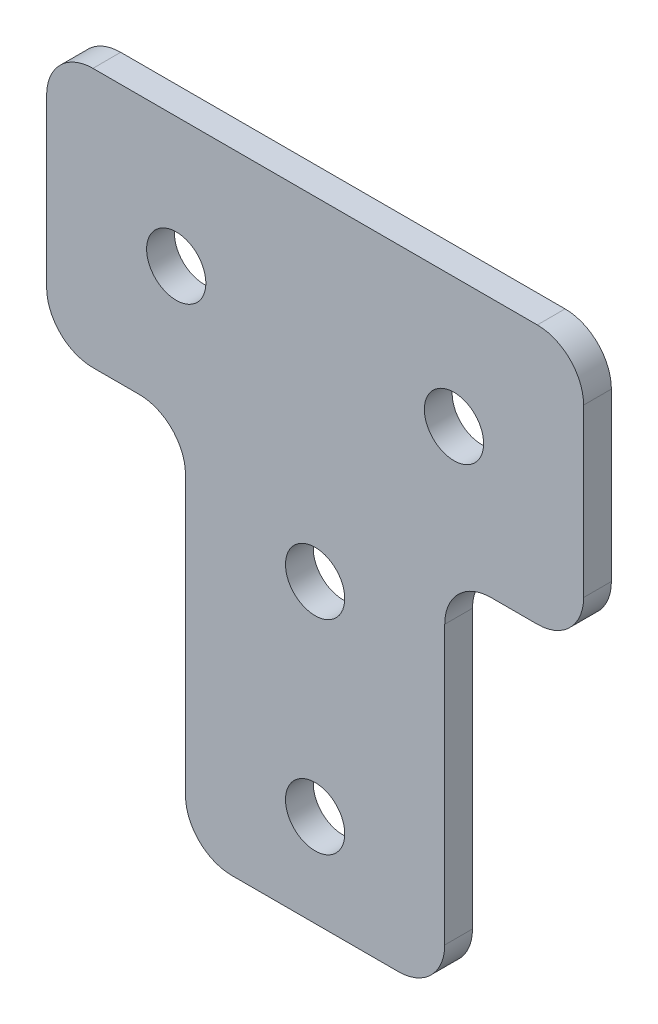
ISO-10303-21;
HEADER;
FILE_DESCRIPTION(('STEP AP214'),'2;1');
FILE_NAME('part.step','',(''),(''),'','','');
FILE_SCHEMA(('AUTOMOTIVE_DESIGN { 1 0 10303 214 1 1 1 1 }'));
ENDSEC;
DATA;
#1=APPLICATION_CONTEXT('core data for automotive mechanical design processes');
#2=APPLICATION_PROTOCOL_DEFINITION('international standard','automotive_design',2000,#1);
#3=PRODUCT_CONTEXT('',#1,'mechanical');
#4=PRODUCT('Part','Part','',(#3));
#5=PRODUCT_RELATED_PRODUCT_CATEGORY('part','',(#4));
#6=PRODUCT_DEFINITION_FORMATION('','',#4);
#7=PRODUCT_DEFINITION_CONTEXT('part definition',#1,'design');
#8=PRODUCT_DEFINITION('design','',#6,#7);
#9=PRODUCT_DEFINITION_SHAPE('','',#8);
#10=(LENGTH_UNIT() NAMED_UNIT(*) SI_UNIT(.MILLI.,.METRE.));
#11=(NAMED_UNIT(*) PLANE_ANGLE_UNIT() SI_UNIT($,.RADIAN.));
#12=(NAMED_UNIT(*) SI_UNIT($,.STERADIAN.) SOLID_ANGLE_UNIT());
#13=UNCERTAINTY_MEASURE_WITH_UNIT(LENGTH_MEASURE(1.E-05),#10,'distance_accuracy_value','');
#14=(GEOMETRIC_REPRESENTATION_CONTEXT(3) GLOBAL_UNCERTAINTY_ASSIGNED_CONTEXT((#13)) GLOBAL_UNIT_ASSIGNED_CONTEXT((#10,
#11,#12)) REPRESENTATION_CONTEXT('',''));
#15=CARTESIAN_POINT('',(0.,0.,0.));
#16=DIRECTION('',(0.,0.,1.));
#17=DIRECTION('',(1.,0.,0.));
#18=AXIS2_PLACEMENT_3D('',#15,#16,#17);
#19=CARTESIAN_POINT('',(-16.5163268204101,5.70798729371791,0.0587796146937763));
#20=DIRECTION('',(1.,0.,0.));
#21=DIRECTION('',(0.,0.,-1.));
#22=AXIS2_PLACEMENT_3D('',#19,#20,#21);
#23=PLANE('',#22);
#24=DIRECTION('',(0.,-1.,0.));
#25=VECTOR('',#24,1.);
#26=CARTESIAN_POINT('',(-16.5163268204101,5.70798729371791,-1.44122038530622));
#27=LINE('',#26,#25);
#28=CARTESIAN_POINT('',(-16.5163268204101,17.2079872937179,-1.44122038530622));
#29=VERTEX_POINT('',#28);
#30=CARTESIAN_POINT('',(-16.5163268204101,8.20798729371791,-1.44122038530622));
#31=VERTEX_POINT('',#30);
#32=EDGE_CURVE('E235',#29,#31,#27,.T.);
#33=ORIENTED_EDGE('',*,*,#32,.T.);
#34=DIRECTION('',(0.,0.,-1.));
#35=VECTOR('',#34,1.);
#36=CARTESIAN_POINT('',(-16.5163268204101,8.20798729371791,0.0587796146937763));
#37=LINE('',#36,#35);
#38=CARTESIAN_POINT('',(-16.5163268204101,8.20798729371791,0.0587796146937763));
#39=VERTEX_POINT('',#38);
#40=EDGE_CURVE('E217',#31,#39,#37,.F.);
#41=ORIENTED_EDGE('',*,*,#40,.T.);
#42=DIRECTION('',(0.,-1.,0.));
#43=VECTOR('',#42,1.);
#44=CARTESIAN_POINT('',(-16.5163268204101,5.70798729371791,0.0587796146937763));
#45=LINE('',#44,#43);
#46=CARTESIAN_POINT('',(-16.5163268204101,17.2079872937179,0.0587796146937763));
#47=VERTEX_POINT('',#46);
#48=EDGE_CURVE('E156',#47,#39,#45,.T.);
#49=ORIENTED_EDGE('',*,*,#48,.F.);
#50=DIRECTION('',(0.,0.,-1.));
#51=VECTOR('',#50,1.);
#52=CARTESIAN_POINT('',(-16.5163268204101,17.2079872937179,0.0587796146937763));
#53=LINE('',#52,#51);
#54=EDGE_CURVE('E214',#47,#29,#53,.T.);
#55=ORIENTED_EDGE('',*,*,#54,.T.);
#56=EDGE_LOOP('',(#33,#41,#49,#55));
#57=FACE_BOUND('',#56,.T.);
#58=ADVANCED_FACE('F16',(#57),#23,.F.);
#59=CARTESIAN_POINT('',(-16.5163268204101,5.70798729371791,0.0587796146937763));
#60=DIRECTION('',(0.,1.,0.));
#61=DIRECTION('',(0.,0.,1.));
#62=AXIS2_PLACEMENT_3D('',#59,#60,#61);
#63=PLANE('',#62);
#64=DIRECTION('',(1.,0.,0.));
#65=VECTOR('',#64,1.);
#66=CARTESIAN_POINT('',(-16.5163268204101,5.70798729371791,-1.44122038530622));
#67=LINE('',#66,#65);
#68=CARTESIAN_POINT('',(-14.0163268204101,5.70798729371791,-1.44122038530622));
#69=VERTEX_POINT('',#68);
#70=CARTESIAN_POINT('',(-11.5163268204101,5.70798729371791,-1.44122038530622));
#71=VERTEX_POINT('',#70);
#72=EDGE_CURVE('E224',#69,#71,#67,.T.);
#73=ORIENTED_EDGE('',*,*,#72,.T.);
#74=DIRECTION('',(0.,0.,-1.));
#75=VECTOR('',#74,1.);
#76=CARTESIAN_POINT('',(-11.5163268204101,5.70798729371791,0.0587796146937763));
#77=LINE('',#76,#75);
#78=CARTESIAN_POINT('',(-11.5163268204101,5.70798729371791,0.0587796146937763));
#79=VERTEX_POINT('',#78);
#80=EDGE_CURVE('E212',#71,#79,#77,.F.);
#81=ORIENTED_EDGE('',*,*,#80,.T.);
#82=DIRECTION('',(1.,0.,0.));
#83=VECTOR('',#82,1.);
#84=CARTESIAN_POINT('',(-16.5163268204101,5.70798729371791,0.0587796146937763));
#85=LINE('',#84,#83);
#86=CARTESIAN_POINT('',(-14.0163268204101,5.70798729371791,0.0587796146937763));
#87=VERTEX_POINT('',#86);
#88=EDGE_CURVE('E160',#87,#79,#85,.T.);
#89=ORIENTED_EDGE('',*,*,#88,.F.);
#90=DIRECTION('',(0.,0.,-1.));
#91=VECTOR('',#90,1.);
#92=CARTESIAN_POINT('',(-14.0163268204101,5.70798729371791,0.0587796146937763));
#93=LINE('',#92,#91);
#94=EDGE_CURVE('E209',#87,#69,#93,.T.);
#95=ORIENTED_EDGE('',*,*,#94,.T.);
#96=EDGE_LOOP('',(#73,#81,#89,#95));
#97=FACE_BOUND('',#96,.T.);
#98=ADVANCED_FACE('F231',(#97),#63,.F.);
#99=CARTESIAN_POINT('',(-9.01632682041008,5.70798729371791,0.0587796146937763));
#100=DIRECTION('',(1.,0.,0.));
#101=DIRECTION('',(0.,1.,0.));
#102=AXIS2_PLACEMENT_3D('',#99,#100,#101);
#103=PLANE('',#102);
#104=DIRECTION('',(0.,-1.,0.));
#105=VECTOR('',#104,1.);
#106=CARTESIAN_POINT('',(-9.01632682041008,5.70798729371791,-1.44122038530622));
#107=LINE('',#106,#105);
#108=CARTESIAN_POINT('',(-9.01632682041008,3.20798729371791,-1.44122038530622));
#109=VERTEX_POINT('',#108);
#110=CARTESIAN_POINT('',(-9.01632682041008,-11.7920127062821,-1.44122038530622));
#111=VERTEX_POINT('',#110);
#112=EDGE_CURVE('E226',#109,#111,#107,.T.);
#113=ORIENTED_EDGE('',*,*,#112,.T.);
#114=DIRECTION('',(0.,0.,-1.));
#115=VECTOR('',#114,1.);
#116=CARTESIAN_POINT('',(-9.01632682041008,-11.7920127062821,0.0587796146937763));
#117=LINE('',#116,#115);
#118=CARTESIAN_POINT('',(-9.01632682041008,-11.7920127062821,0.0587796146937763));
#119=VERTEX_POINT('',#118);
#120=EDGE_CURVE('E207',#111,#119,#117,.F.);
#121=ORIENTED_EDGE('',*,*,#120,.T.);
#122=DIRECTION('',(0.,-1.,0.));
#123=VECTOR('',#122,1.);
#124=CARTESIAN_POINT('',(-9.01632682041008,5.70798729371791,0.0587796146937763));
#125=LINE('',#124,#123);
#126=CARTESIAN_POINT('',(-9.01632682041008,3.20798729371791,0.0587796146937763));
#127=VERTEX_POINT('',#126);
#128=EDGE_CURVE('E243',#127,#119,#125,.T.);
#129=ORIENTED_EDGE('',*,*,#128,.F.);
#130=DIRECTION('',(0.,0.,-1.));
#131=VECTOR('',#130,1.);
#132=CARTESIAN_POINT('',(-9.01632682041008,3.20798729371791,-1.44122038530622));
#133=LINE('',#132,#131);
#134=EDGE_CURVE('E204',#127,#109,#133,.T.);
#135=ORIENTED_EDGE('',*,*,#134,.T.);
#136=EDGE_LOOP('',(#113,#121,#129,#135));
#137=FACE_BOUND('',#136,.T.);
#138=ADVANCED_FACE('F246',(#137),#103,.F.);
#139=CARTESIAN_POINT('',(-9.01632682041008,-14.2920127062821,0.0587796146937763));
#140=DIRECTION('',(0.,1.,0.));
#141=DIRECTION('',(0.,0.,1.));
#142=AXIS2_PLACEMENT_3D('',#139,#140,#141);
#143=PLANE('',#142);
#144=DIRECTION('',(1.,0.,0.));
#145=VECTOR('',#144,1.);
#146=CARTESIAN_POINT('',(-9.01632682041008,-14.2920127062821,-1.44122038530622));
#147=LINE('',#146,#145);
#148=CARTESIAN_POINT('',(-6.51632682041008,-14.2920127062821,-1.44122038530622));
#149=VERTEX_POINT('',#148);
#150=CARTESIAN_POINT('',(2.48367317958991,-14.2920127062821,-1.44122038530622));
#151=VERTEX_POINT('',#150);
#152=EDGE_CURVE('E265',#149,#151,#147,.T.);
#153=ORIENTED_EDGE('',*,*,#152,.T.);
#154=DIRECTION('',(0.,0.,-1.));
#155=VECTOR('',#154,1.);
#156=CARTESIAN_POINT('',(2.48367317958992,-14.2920127062821,0.0587796146937763));
#157=LINE('',#156,#155);
#158=CARTESIAN_POINT('',(2.48367317958991,-14.2920127062821,0.0587796146937763));
#159=VERTEX_POINT('',#158);
#160=EDGE_CURVE('E202',#151,#159,#157,.F.);
#161=ORIENTED_EDGE('',*,*,#160,.T.);
#162=DIRECTION('',(1.,0.,0.));
#163=VECTOR('',#162,1.);
#164=CARTESIAN_POINT('',(-9.01632682041008,-14.2920127062821,0.0587796146937763));
#165=LINE('',#164,#163);
#166=CARTESIAN_POINT('',(-6.51632682041008,-14.2920127062821,0.0587796146937763));
#167=VERTEX_POINT('',#166);
#168=EDGE_CURVE('E248',#167,#159,#165,.T.);
#169=ORIENTED_EDGE('',*,*,#168,.F.);
#170=DIRECTION('',(0.,0.,-1.));
#171=VECTOR('',#170,1.);
#172=CARTESIAN_POINT('',(-6.51632682041008,-14.2920127062821,0.0587796146937763));
#173=LINE('',#172,#171);
#174=EDGE_CURVE('E199',#167,#149,#173,.T.);
#175=ORIENTED_EDGE('',*,*,#174,.T.);
#176=EDGE_LOOP('',(#153,#161,#169,#175));
#177=FACE_BOUND('',#176,.T.);
#178=ADVANCED_FACE('F499',(#177),#143,.F.);
#179=CARTESIAN_POINT('',(4.98367317958992,-14.2920127062821,0.0587796146937763));
#180=DIRECTION('',(-1.,0.,0.));
#181=DIRECTION('',(0.,0.,1.));
#182=AXIS2_PLACEMENT_3D('',#179,#180,#181);
#183=PLANE('',#182);
#184=DIRECTION('',(0.,1.,0.));
#185=VECTOR('',#184,1.);
#186=CARTESIAN_POINT('',(4.98367317958992,-14.2920127062821,-1.44122038530622));
#187=LINE('',#186,#185);
#188=CARTESIAN_POINT('',(4.98367317958992,-11.7920127062821,-1.44122038530622));
#189=VERTEX_POINT('',#188);
#190=CARTESIAN_POINT('',(4.98367317958992,3.20798729371791,-1.44122038530622));
#191=VERTEX_POINT('',#190);
#192=EDGE_CURVE('E268',#189,#191,#187,.T.);
#193=ORIENTED_EDGE('',*,*,#192,.T.);
#194=DIRECTION('',(0.,0.,-1.));
#195=VECTOR('',#194,1.);
#196=CARTESIAN_POINT('',(4.98367317958992,3.20798729371791,0.0587796146937763));
#197=LINE('',#196,#195);
#198=CARTESIAN_POINT('',(4.98367317958992,3.20798729371791,0.0587796146937763));
#199=VERTEX_POINT('',#198);
#200=EDGE_CURVE('E197',#191,#199,#197,.F.);
#201=ORIENTED_EDGE('',*,*,#200,.T.);
#202=DIRECTION('',(0.,1.,0.));
#203=VECTOR('',#202,1.);
#204=CARTESIAN_POINT('',(4.98367317958992,-14.2920127062821,0.0587796146937763));
#205=LINE('',#204,#203);
#206=CARTESIAN_POINT('',(4.98367317958992,-11.7920127062821,0.0587796146937763));
#207=VERTEX_POINT('',#206);
#208=EDGE_CURVE('E251',#207,#199,#205,.T.);
#209=ORIENTED_EDGE('',*,*,#208,.F.);
#210=DIRECTION('',(0.,0.,-1.));
#211=VECTOR('',#210,1.);
#212=CARTESIAN_POINT('',(4.98367317958992,-11.7920127062821,0.0587796146937763));
#213=LINE('',#212,#211);
#214=EDGE_CURVE('E194',#207,#189,#213,.T.);
#215=ORIENTED_EDGE('',*,*,#214,.T.);
#216=EDGE_LOOP('',(#193,#201,#209,#215));
#217=FACE_BOUND('',#216,.T.);
#218=ADVANCED_FACE('F288',(#217),#183,.F.);
#219=CARTESIAN_POINT('',(4.98367317958992,5.70798729371791,0.0587796146937763));
#220=DIRECTION('',(0.,1.,0.));
#221=DIRECTION('',(0.,0.,1.));
#222=AXIS2_PLACEMENT_3D('',#219,#220,#221);
#223=PLANE('',#222);
#224=DIRECTION('',(1.,0.,0.));
#225=VECTOR('',#224,1.);
#226=CARTESIAN_POINT('',(4.98367317958992,5.70798729371791,-1.44122038530622));
#227=LINE('',#226,#225);
#228=CARTESIAN_POINT('',(7.48367317958992,5.70798729371791,-1.44122038530622));
#229=VERTEX_POINT('',#228);
#230=CARTESIAN_POINT('',(9.98367317958992,5.70798729371791,-1.44122038530622));
#231=VERTEX_POINT('',#230);
#232=EDGE_CURVE('E162',#229,#231,#227,.T.);
#233=ORIENTED_EDGE('',*,*,#232,.T.);
#234=DIRECTION('',(0.,0.,-1.));
#235=VECTOR('',#234,1.);
#236=CARTESIAN_POINT('',(9.98367317958992,5.70798729371791,0.0587796146937763));
#237=LINE('',#236,#235);
#238=CARTESIAN_POINT('',(9.98367317958992,5.70798729371791,0.0587796146937763));
#239=VERTEX_POINT('',#238);
#240=EDGE_CURVE('E31',#231,#239,#237,.F.);
#241=ORIENTED_EDGE('',*,*,#240,.T.);
#242=DIRECTION('',(1.,0.,0.));
#243=VECTOR('',#242,1.);
#244=CARTESIAN_POINT('',(4.98367317958992,5.70798729371791,0.0587796146937763));
#245=LINE('',#244,#243);
#246=CARTESIAN_POINT('',(7.48367317958992,5.70798729371791,0.0587796146937763));
#247=VERTEX_POINT('',#246);
#248=EDGE_CURVE('E256',#247,#239,#245,.T.);
#249=ORIENTED_EDGE('',*,*,#248,.F.);
#250=DIRECTION('',(0.,0.,-1.));
#251=VECTOR('',#250,1.);
#252=CARTESIAN_POINT('',(7.48367317958992,5.70798729371791,-1.44122038530622));
#253=LINE('',#252,#251);
#254=EDGE_CURVE('E190',#247,#229,#253,.T.);
#255=ORIENTED_EDGE('',*,*,#254,.T.);
#256=EDGE_LOOP('',(#233,#241,#249,#255));
#257=FACE_BOUND('',#256,.T.);
#258=ADVANCED_FACE('F271',(#257),#223,.F.);
#259=CARTESIAN_POINT('',(12.4836731795899,5.70798729371791,0.0587796146937763));
#260=DIRECTION('',(-1.,0.,0.));
#261=DIRECTION('',(0.,0.,1.));
#262=AXIS2_PLACEMENT_3D('',#259,#260,#261);
#263=PLANE('',#262);
#264=DIRECTION('',(0.,1.,0.));
#265=VECTOR('',#264,1.);
#266=CARTESIAN_POINT('',(12.4836731795899,5.70798729371791,-1.44122038530622));
#267=LINE('',#266,#265);
#268=CARTESIAN_POINT('',(12.4836731795899,8.20798729371791,-1.44122038530622));
#269=VERTEX_POINT('',#268);
#270=CARTESIAN_POINT('',(12.4836731795899,17.2079872937179,-1.44122038530622));
#271=VERTEX_POINT('',#270);
#272=EDGE_CURVE('E157',#269,#271,#267,.T.);
#273=ORIENTED_EDGE('',*,*,#272,.T.);
#274=DIRECTION('',(0.,0.,-1.));
#275=VECTOR('',#274,1.);
#276=CARTESIAN_POINT('',(12.4836731795899,17.2079872937179,0.0587796146937763));
#277=LINE('',#276,#275);
#278=CARTESIAN_POINT('',(12.4836731795899,17.2079872937179,0.0587796146937763));
#279=VERTEX_POINT('',#278);
#280=EDGE_CURVE('E135',#271,#279,#277,.F.);
#281=ORIENTED_EDGE('',*,*,#280,.T.);
#282=DIRECTION('',(0.,1.,0.));
#283=VECTOR('',#282,1.);
#284=CARTESIAN_POINT('',(12.4836731795899,5.70798729371791,0.0587796146937763));
#285=LINE('',#284,#283);
#286=CARTESIAN_POINT('',(12.4836731795899,8.20798729371791,0.0587796146937763));
#287=VERTEX_POINT('',#286);
#288=EDGE_CURVE('E258',#287,#279,#285,.T.);
#289=ORIENTED_EDGE('',*,*,#288,.F.);
#290=DIRECTION('',(0.,0.,-1.));
#291=VECTOR('',#290,1.);
#292=CARTESIAN_POINT('',(12.4836731795899,8.20798729371791,0.0587796146937763));
#293=LINE('',#292,#291);
#294=EDGE_CURVE('E140',#287,#269,#293,.T.);
#295=ORIENTED_EDGE('',*,*,#294,.T.);
#296=EDGE_LOOP('',(#273,#281,#289,#295));
#297=FACE_BOUND('',#296,.T.);
#298=ADVANCED_FACE('F279',(#297),#263,.F.);
#299=CARTESIAN_POINT('',(-16.5163268204101,19.7079872937179,0.0587796146937763));
#300=DIRECTION('',(0.,-1.,0.));
#301=DIRECTION('',(0.,0.,-1.));
#302=AXIS2_PLACEMENT_3D('',#299,#300,#301);
#303=PLANE('',#302);
#304=DIRECTION('',(-1.,0.,0.));
#305=VECTOR('',#304,1.);
#306=CARTESIAN_POINT('',(-16.5163268204101,19.7079872937179,0.0587796146937763));
#307=LINE('',#306,#305);
#308=CARTESIAN_POINT('',(9.98367317958991,19.7079872937179,0.0587796146937763));
#309=VERTEX_POINT('',#308);
#310=CARTESIAN_POINT('',(-14.0163268204101,19.7079872937179,0.0587796146937763));
#311=VERTEX_POINT('',#310);
#312=EDGE_CURVE('E150',#309,#311,#307,.T.);
#313=ORIENTED_EDGE('',*,*,#312,.F.);
#314=DIRECTION('',(0.,0.,-1.));
#315=VECTOR('',#314,1.);
#316=CARTESIAN_POINT('',(9.98367317958992,19.7079872937179,0.0587796146937763));
#317=LINE('',#316,#315);
#318=CARTESIAN_POINT('',(9.98367317958991,19.7079872937179,-1.44122038530622));
#319=VERTEX_POINT('',#318);
#320=EDGE_CURVE('E134',#309,#319,#317,.T.);
#321=ORIENTED_EDGE('',*,*,#320,.T.);
#322=DIRECTION('',(-1.,0.,0.));
#323=VECTOR('',#322,1.);
#324=CARTESIAN_POINT('',(-16.5163268204101,19.7079872937179,-1.44122038530622));
#325=LINE('',#324,#323);
#326=CARTESIAN_POINT('',(-14.0163268204101,19.7079872937179,-1.44122038530622));
#327=VERTEX_POINT('',#326);
#328=EDGE_CURVE('E147',#319,#327,#325,.T.);
#329=ORIENTED_EDGE('',*,*,#328,.T.);
#330=DIRECTION('',(0.,0.,-1.));
#331=VECTOR('',#330,1.);
#332=CARTESIAN_POINT('',(-14.0163268204101,19.7079872937179,0.0587796146937763));
#333=LINE('',#332,#331);
#334=EDGE_CURVE('E152',#327,#311,#333,.F.);
#335=ORIENTED_EDGE('',*,*,#334,.T.);
#336=EDGE_LOOP('',(#313,#321,#329,#335));
#337=FACE_BOUND('',#336,.T.);
#338=ADVANCED_FACE('F146',(#337),#303,.F.);
#339=CARTESIAN_POINT('',(-16.5163268204101,5.70798729371791,0.0587796146937763));
#340=DIRECTION('',(0.,0.,-1.));
#341=DIRECTION('',(-1.,0.,0.));
#342=AXIS2_PLACEMENT_3D('',#339,#340,#341);
#343=PLANE('',#342);
#344=CARTESIAN_POINT('',(-9.51632682041008,12.7079872937179,0.0587796146937763));
#345=DIRECTION('',(0.,0.,1.));
#346=DIRECTION('',(1.,0.,0.));
#347=AXIS2_PLACEMENT_3D('',#344,#345,#346);
#348=CIRCLE('',#347,1.6);
#349=CARTESIAN_POINT('',(-7.91632682041008,12.7079872937179,0.0587796146937763));
#350=VERTEX_POINT('',#349);
#351=EDGE_CURVE('E366',#350,#350,#348,.T.);
#352=ORIENTED_EDGE('',*,*,#351,.F.);
#353=EDGE_LOOP('',(#352));
#354=FACE_BOUND('',#353,.T.);
#355=CARTESIAN_POINT('',(-2.01632682041008,1.7079872937179,0.0587796146937763));
#356=DIRECTION('',(0.,0.,1.));
#357=DIRECTION('',(1.,0.,0.));
#358=AXIS2_PLACEMENT_3D('',#355,#356,#357);
#359=CIRCLE('',#358,1.6);
#360=CARTESIAN_POINT('',(-0.416326820410081,1.7079872937179,0.0587796146937763));
#361=VERTEX_POINT('',#360);
#362=EDGE_CURVE('E374',#361,#361,#359,.T.);
#363=ORIENTED_EDGE('',*,*,#362,.F.);
#364=EDGE_LOOP('',(#363));
#365=FACE_BOUND('',#364,.T.);
#366=CARTESIAN_POINT('',(-2.01632682041008,-9.29201270628209,0.0587796146937763));
#367=DIRECTION('',(0.,0.,1.));
#368=DIRECTION('',(1.,0.,0.));
#369=AXIS2_PLACEMENT_3D('',#366,#367,#368);
#370=CIRCLE('',#369,1.6);
#371=CARTESIAN_POINT('',(-0.416326820410081,-9.29201270628209,0.0587796146937763));
#372=VERTEX_POINT('',#371);
#373=EDGE_CURVE('E378',#372,#372,#370,.T.);
#374=ORIENTED_EDGE('',*,*,#373,.F.);
#375=EDGE_LOOP('',(#374));
#376=FACE_BOUND('',#375,.T.);
#377=CARTESIAN_POINT('',(5.48367317958992,12.7079872937179,0.0587796146937763));
#378=DIRECTION('',(0.,0.,1.));
#379=DIRECTION('',(-1.,0.,0.));
#380=AXIS2_PLACEMENT_3D('',#377,#378,#379);
#381=CIRCLE('',#380,1.6);
#382=CARTESIAN_POINT('',(3.88367317958992,12.7079872937179,0.0587796146937763));
#383=VERTEX_POINT('',#382);
#384=EDGE_CURVE('E367',#383,#383,#381,.T.);
#385=ORIENTED_EDGE('',*,*,#384,.F.);
#386=EDGE_LOOP('',(#385));
#387=FACE_BOUND('',#386,.T.);
#388=ORIENTED_EDGE('',*,*,#288,.T.);
#389=CARTESIAN_POINT('',(9.98367317958992,17.2079872937179,0.0587796146937763));
#390=DIRECTION('',(0.,0.,-1.));
#391=DIRECTION('',(-1.,0.,0.));
#392=AXIS2_PLACEMENT_3D('',#389,#390,#391);
#393=CIRCLE('',#392,2.5);
#394=EDGE_CURVE('E188',#279,#309,#393,.F.);
#395=ORIENTED_EDGE('',*,*,#394,.T.);
#396=ORIENTED_EDGE('',*,*,#312,.T.);
#397=CARTESIAN_POINT('',(-14.0163268204101,17.2079872937179,0.0587796146937763));
#398=DIRECTION('',(0.,0.,-1.));
#399=DIRECTION('',(-1.,0.,0.));
#400=AXIS2_PLACEMENT_3D('',#397,#398,#399);
#401=CIRCLE('',#400,2.5);
#402=EDGE_CURVE('E178',#311,#47,#401,.F.);
#403=ORIENTED_EDGE('',*,*,#402,.T.);
#404=ORIENTED_EDGE('',*,*,#48,.T.);
#405=CARTESIAN_POINT('',(-14.0163268204101,8.20798729371791,0.0587796146937763));
#406=DIRECTION('',(0.,0.,-1.));
#407=DIRECTION('',(-1.,0.,0.));
#408=AXIS2_PLACEMENT_3D('',#405,#406,#407);
#409=CIRCLE('',#408,2.5);
#410=EDGE_CURVE('E180',#39,#87,#409,.F.);
#411=ORIENTED_EDGE('',*,*,#410,.T.);
#412=ORIENTED_EDGE('',*,*,#88,.T.);
#413=CARTESIAN_POINT('',(-11.5163268204101,3.20798729371791,0.0587796146937763));
#414=DIRECTION('',(0.,0.,-1.));
#415=DIRECTION('',(-1.,0.,0.));
#416=AXIS2_PLACEMENT_3D('',#413,#414,#415);
#417=CIRCLE('',#416,2.5);
#418=EDGE_CURVE('E10',#79,#127,#417,.T.);
#419=ORIENTED_EDGE('',*,*,#418,.T.);
#420=ORIENTED_EDGE('',*,*,#128,.T.);
#421=CARTESIAN_POINT('',(-6.51632682041008,-11.7920127062821,0.0587796146937763));
#422=DIRECTION('',(0.,0.,-1.));
#423=DIRECTION('',(-1.,0.,0.));
#424=AXIS2_PLACEMENT_3D('',#421,#422,#423);
#425=CIRCLE('',#424,2.5);
#426=EDGE_CURVE('E182',#119,#167,#425,.F.);
#427=ORIENTED_EDGE('',*,*,#426,.T.);
#428=ORIENTED_EDGE('',*,*,#168,.T.);
#429=CARTESIAN_POINT('',(2.48367317958992,-11.7920127062821,0.0587796146937763));
#430=DIRECTION('',(0.,0.,-1.));
#431=DIRECTION('',(-1.,0.,0.));
#432=AXIS2_PLACEMENT_3D('',#429,#430,#431);
#433=CIRCLE('',#432,2.5);
#434=EDGE_CURVE('E184',#159,#207,#433,.F.);
#435=ORIENTED_EDGE('',*,*,#434,.T.);
#436=ORIENTED_EDGE('',*,*,#208,.T.);
#437=CARTESIAN_POINT('',(7.48367317958992,3.20798729371791,0.0587796146937763));
#438=DIRECTION('',(0.,0.,-1.));
#439=DIRECTION('',(-1.,0.,0.));
#440=AXIS2_PLACEMENT_3D('',#437,#438,#439);
#441=CIRCLE('',#440,2.5);
#442=EDGE_CURVE('E38',#199,#247,#441,.T.);
#443=ORIENTED_EDGE('',*,*,#442,.T.);
#444=ORIENTED_EDGE('',*,*,#248,.T.);
#445=CARTESIAN_POINT('',(9.98367317958992,8.20798729371791,0.0587796146937763));
#446=DIRECTION('',(0.,0.,-1.));
#447=DIRECTION('',(-1.,0.,0.));
#448=AXIS2_PLACEMENT_3D('',#445,#446,#447);
#449=CIRCLE('',#448,2.5);
#450=EDGE_CURVE('E186',#239,#287,#449,.F.);
#451=ORIENTED_EDGE('',*,*,#450,.T.);
#452=EDGE_LOOP('',(#388,#395,#396,#403,#404,#411,#412,#419,#420,#427,#428,#435,#436,#443,#444,#451));
#453=FACE_BOUND('',#452,.T.);
#454=ADVANCED_FACE('F242',(#354,#365,#376,#387,#453),#343,.F.);
#455=CARTESIAN_POINT('',(-16.5163268204101,5.70798729371791,-1.44122038530622));
#456=DIRECTION('',(0.,0.,-1.));
#457=DIRECTION('',(-1.,0.,0.));
#458=AXIS2_PLACEMENT_3D('',#455,#456,#457);
#459=PLANE('',#458);
#460=CARTESIAN_POINT('',(-9.51632682041008,12.7079872937179,-1.44122038530622));
#461=DIRECTION('',(0.,0.,1.));
#462=DIRECTION('',(1.,0.,0.));
#463=AXIS2_PLACEMENT_3D('',#460,#461,#462);
#464=CIRCLE('',#463,1.6);
#465=CARTESIAN_POINT('',(-7.91632682041008,12.7079872937179,-1.44122038530622));
#466=VERTEX_POINT('',#465);
#467=EDGE_CURVE('E262',#466,#466,#464,.T.);
#468=ORIENTED_EDGE('',*,*,#467,.T.);
#469=EDGE_LOOP('',(#468));
#470=FACE_BOUND('',#469,.T.);
#471=CARTESIAN_POINT('',(-2.01632682041008,1.7079872937179,-1.44122038530622));
#472=DIRECTION('',(0.,0.,1.));
#473=DIRECTION('',(1.,0.,0.));
#474=AXIS2_PLACEMENT_3D('',#471,#472,#473);
#475=CIRCLE('',#474,1.6);
#476=CARTESIAN_POINT('',(-0.416326820410081,1.7079872937179,-1.44122038530622));
#477=VERTEX_POINT('',#476);
#478=EDGE_CURVE('E359',#477,#477,#475,.T.);
#479=ORIENTED_EDGE('',*,*,#478,.T.);
#480=EDGE_LOOP('',(#479));
#481=FACE_BOUND('',#480,.T.);
#482=CARTESIAN_POINT('',(-2.01632682041008,-9.29201270628209,-1.44122038530622));
#483=DIRECTION('',(0.,0.,1.));
#484=DIRECTION('',(1.,0.,0.));
#485=AXIS2_PLACEMENT_3D('',#482,#483,#484);
#486=CIRCLE('',#485,1.6);
#487=CARTESIAN_POINT('',(-0.416326820410081,-9.29201270628209,-1.44122038530622));
#488=VERTEX_POINT('',#487);
#489=EDGE_CURVE('E363',#488,#488,#486,.T.);
#490=ORIENTED_EDGE('',*,*,#489,.T.);
#491=EDGE_LOOP('',(#490));
#492=FACE_BOUND('',#491,.T.);
#493=CARTESIAN_POINT('',(5.48367317958992,12.7079872937179,-1.44122038530622));
#494=DIRECTION('',(0.,0.,1.));
#495=DIRECTION('',(-1.,0.,0.));
#496=AXIS2_PLACEMENT_3D('',#493,#494,#495);
#497=CIRCLE('',#496,1.6);
#498=CARTESIAN_POINT('',(3.88367317958992,12.7079872937179,-1.44122038530622));
#499=VERTEX_POINT('',#498);
#500=EDGE_CURVE('E365',#499,#499,#497,.T.);
#501=ORIENTED_EDGE('',*,*,#500,.T.);
#502=EDGE_LOOP('',(#501));
#503=FACE_BOUND('',#502,.T.);
#504=ORIENTED_EDGE('',*,*,#328,.F.);
#505=CARTESIAN_POINT('',(9.98367317958992,17.2079872937179,-1.44122038530622));
#506=DIRECTION('',(0.,0.,-1.));
#507=DIRECTION('',(-1.,0.,0.));
#508=AXIS2_PLACEMENT_3D('',#505,#506,#507);
#509=CIRCLE('',#508,2.5);
#510=EDGE_CURVE('E130',#319,#271,#509,.T.);
#511=ORIENTED_EDGE('',*,*,#510,.T.);
#512=ORIENTED_EDGE('',*,*,#272,.F.);
#513=CARTESIAN_POINT('',(9.98367317958992,8.20798729371791,-1.44122038530622));
#514=DIRECTION('',(0.,0.,-1.));
#515=DIRECTION('',(-1.,0.,0.));
#516=AXIS2_PLACEMENT_3D('',#513,#514,#515);
#517=CIRCLE('',#516,2.5);
#518=EDGE_CURVE('E141',#269,#231,#517,.T.);
#519=ORIENTED_EDGE('',*,*,#518,.T.);
#520=ORIENTED_EDGE('',*,*,#232,.F.);
#521=CARTESIAN_POINT('',(7.48367317958992,3.20798729371791,-1.44122038530622));
#522=DIRECTION('',(0.,0.,-1.));
#523=DIRECTION('',(-1.,0.,0.));
#524=AXIS2_PLACEMENT_3D('',#521,#522,#523);
#525=CIRCLE('',#524,2.5);
#526=EDGE_CURVE('E219',#229,#191,#525,.F.);
#527=ORIENTED_EDGE('',*,*,#526,.T.);
#528=ORIENTED_EDGE('',*,*,#192,.F.);
#529=CARTESIAN_POINT('',(2.48367317958992,-11.7920127062821,-1.44122038530622));
#530=DIRECTION('',(0.,0.,-1.));
#531=DIRECTION('',(-1.,0.,0.));
#532=AXIS2_PLACEMENT_3D('',#529,#530,#531);
#533=CIRCLE('',#532,2.5);
#534=EDGE_CURVE('E172',#189,#151,#533,.T.);
#535=ORIENTED_EDGE('',*,*,#534,.T.);
#536=ORIENTED_EDGE('',*,*,#152,.F.);
#537=CARTESIAN_POINT('',(-6.51632682041008,-11.7920127062821,-1.44122038530622));
#538=DIRECTION('',(0.,0.,-1.));
#539=DIRECTION('',(-1.,0.,0.));
#540=AXIS2_PLACEMENT_3D('',#537,#538,#539);
#541=CIRCLE('',#540,2.5);
#542=EDGE_CURVE('E170',#149,#111,#541,.T.);
#543=ORIENTED_EDGE('',*,*,#542,.T.);
#544=ORIENTED_EDGE('',*,*,#112,.F.);
#545=CARTESIAN_POINT('',(-11.5163268204101,3.20798729371791,-1.44122038530622));
#546=DIRECTION('',(0.,0.,-1.));
#547=DIRECTION('',(-1.,0.,0.));
#548=AXIS2_PLACEMENT_3D('',#545,#546,#547);
#549=CIRCLE('',#548,2.5);
#550=EDGE_CURVE('E24',#109,#71,#549,.F.);
#551=ORIENTED_EDGE('',*,*,#550,.T.);
#552=ORIENTED_EDGE('',*,*,#72,.F.);
#553=CARTESIAN_POINT('',(-14.0163268204101,8.20798729371791,-1.44122038530622));
#554=DIRECTION('',(0.,0.,-1.));
#555=DIRECTION('',(-1.,0.,0.));
#556=AXIS2_PLACEMENT_3D('',#553,#554,#555);
#557=CIRCLE('',#556,2.5);
#558=EDGE_CURVE('E168',#69,#31,#557,.T.);
#559=ORIENTED_EDGE('',*,*,#558,.T.);
#560=ORIENTED_EDGE('',*,*,#32,.F.);
#561=CARTESIAN_POINT('',(-14.0163268204101,17.2079872937179,-1.44122038530622));
#562=DIRECTION('',(0.,0.,-1.));
#563=DIRECTION('',(-1.,0.,0.));
#564=AXIS2_PLACEMENT_3D('',#561,#562,#563);
#565=CIRCLE('',#564,2.5);
#566=EDGE_CURVE('E151',#29,#327,#565,.T.);
#567=ORIENTED_EDGE('',*,*,#566,.T.);
#568=EDGE_LOOP('',(#504,#511,#512,#519,#520,#527,#528,#535,#536,#543,#544,#551,#552,#559,#560,#567));
#569=FACE_BOUND('',#568,.T.);
#570=ADVANCED_FACE('F154',(#470,#481,#492,#503,#569),#459,.T.);
#571=CARTESIAN_POINT('',(9.98367317958992,17.2079872937179,0.0587796146937763));
#572=DIRECTION('',(0.,0.,-1.));
#573=DIRECTION('',(-1.,0.,0.));
#574=AXIS2_PLACEMENT_3D('',#571,#572,#573);
#575=CYLINDRICAL_SURFACE('',#574,2.5);
#576=ORIENTED_EDGE('',*,*,#394,.F.);
#577=ORIENTED_EDGE('',*,*,#280,.F.);
#578=ORIENTED_EDGE('',*,*,#510,.F.);
#579=ORIENTED_EDGE('',*,*,#320,.F.);
#580=EDGE_LOOP('',(#576,#577,#578,#579));
#581=FACE_BOUND('',#580,.T.);
#582=ADVANCED_FACE('F133',(#581),#575,.T.);
#583=CARTESIAN_POINT('',(9.98367317958992,8.20798729371791,0.0587796146937763));
#584=DIRECTION('',(0.,0.,-1.));
#585=DIRECTION('',(-1.,0.,0.));
#586=AXIS2_PLACEMENT_3D('',#583,#584,#585);
#587=CYLINDRICAL_SURFACE('',#586,2.5);
#588=ORIENTED_EDGE('',*,*,#450,.F.);
#589=ORIENTED_EDGE('',*,*,#240,.F.);
#590=ORIENTED_EDGE('',*,*,#518,.F.);
#591=ORIENTED_EDGE('',*,*,#294,.F.);
#592=EDGE_LOOP('',(#588,#589,#590,#591));
#593=FACE_BOUND('',#592,.T.);
#594=ADVANCED_FACE('F275',(#593),#587,.T.);
#595=CARTESIAN_POINT('',(7.48367317958992,3.20798729371791,0.0587796146937763));
#596=DIRECTION('',(0.,0.,1.));
#597=DIRECTION('',(1.,0.,0.));
#598=AXIS2_PLACEMENT_3D('',#595,#596,#597);
#599=CYLINDRICAL_SURFACE('',#598,2.5);
#600=ORIENTED_EDGE('',*,*,#442,.F.);
#601=ORIENTED_EDGE('',*,*,#200,.F.);
#602=ORIENTED_EDGE('',*,*,#526,.F.);
#603=ORIENTED_EDGE('',*,*,#254,.F.);
#604=EDGE_LOOP('',(#600,#601,#602,#603));
#605=FACE_BOUND('',#604,.T.);
#606=ADVANCED_FACE('F303',(#605),#599,.F.);
#607=CARTESIAN_POINT('',(2.48367317958992,-11.7920127062821,0.0587796146937763));
#608=DIRECTION('',(0.,0.,-1.));
#609=DIRECTION('',(-1.,0.,0.));
#610=AXIS2_PLACEMENT_3D('',#607,#608,#609);
#611=CYLINDRICAL_SURFACE('',#610,2.5);
#612=ORIENTED_EDGE('',*,*,#434,.F.);
#613=ORIENTED_EDGE('',*,*,#160,.F.);
#614=ORIENTED_EDGE('',*,*,#534,.F.);
#615=ORIENTED_EDGE('',*,*,#214,.F.);
#616=EDGE_LOOP('',(#612,#613,#614,#615));
#617=FACE_BOUND('',#616,.T.);
#618=ADVANCED_FACE('F306',(#617),#611,.T.);
#619=CARTESIAN_POINT('',(-6.51632682041008,-11.7920127062821,0.0587796146937763));
#620=DIRECTION('',(0.,0.,-1.));
#621=DIRECTION('',(-1.,0.,0.));
#622=AXIS2_PLACEMENT_3D('',#619,#620,#621);
#623=CYLINDRICAL_SURFACE('',#622,2.5);
#624=ORIENTED_EDGE('',*,*,#426,.F.);
#625=ORIENTED_EDGE('',*,*,#120,.F.);
#626=ORIENTED_EDGE('',*,*,#542,.F.);
#627=ORIENTED_EDGE('',*,*,#174,.F.);
#628=EDGE_LOOP('',(#624,#625,#626,#627));
#629=FACE_BOUND('',#628,.T.);
#630=ADVANCED_FACE('F310',(#629),#623,.T.);
#631=CARTESIAN_POINT('',(-11.5163268204101,3.20798729371791,0.0587796146937763));
#632=DIRECTION('',(0.,0.,1.));
#633=DIRECTION('',(1.,0.,0.));
#634=AXIS2_PLACEMENT_3D('',#631,#632,#633);
#635=CYLINDRICAL_SURFACE('',#634,2.5);
#636=ORIENTED_EDGE('',*,*,#418,.F.);
#637=ORIENTED_EDGE('',*,*,#80,.F.);
#638=ORIENTED_EDGE('',*,*,#550,.F.);
#639=ORIENTED_EDGE('',*,*,#134,.F.);
#640=EDGE_LOOP('',(#636,#637,#638,#639));
#641=FACE_BOUND('',#640,.T.);
#642=ADVANCED_FACE('F238',(#641),#635,.F.);
#643=CARTESIAN_POINT('',(-14.0163268204101,8.20798729371791,0.0587796146937763));
#644=DIRECTION('',(0.,0.,-1.));
#645=DIRECTION('',(-1.,0.,0.));
#646=AXIS2_PLACEMENT_3D('',#643,#644,#645);
#647=CYLINDRICAL_SURFACE('',#646,2.5);
#648=ORIENTED_EDGE('',*,*,#410,.F.);
#649=ORIENTED_EDGE('',*,*,#40,.F.);
#650=ORIENTED_EDGE('',*,*,#558,.F.);
#651=ORIENTED_EDGE('',*,*,#94,.F.);
#652=EDGE_LOOP('',(#648,#649,#650,#651));
#653=FACE_BOUND('',#652,.T.);
#654=ADVANCED_FACE('F316',(#653),#647,.T.);
#655=CARTESIAN_POINT('',(-14.0163268204101,17.2079872937179,0.0587796146937763));
#656=DIRECTION('',(0.,0.,-1.));
#657=DIRECTION('',(-1.,0.,0.));
#658=AXIS2_PLACEMENT_3D('',#655,#656,#657);
#659=CYLINDRICAL_SURFACE('',#658,2.5);
#660=ORIENTED_EDGE('',*,*,#402,.F.);
#661=ORIENTED_EDGE('',*,*,#334,.F.);
#662=ORIENTED_EDGE('',*,*,#566,.F.);
#663=ORIENTED_EDGE('',*,*,#54,.F.);
#664=EDGE_LOOP('',(#660,#661,#662,#663));
#665=FACE_BOUND('',#664,.T.);
#666=ADVANCED_FACE('F18',(#665),#659,.T.);
#667=CARTESIAN_POINT('',(5.48367317958992,12.7079872937179,-1.44122038530622));
#668=DIRECTION('',(0.,0.,1.));
#669=DIRECTION('',(1.,0.,0.));
#670=AXIS2_PLACEMENT_3D('',#667,#668,#669);
#671=CYLINDRICAL_SURFACE('',#670,1.6);
#672=ORIENTED_EDGE('',*,*,#500,.F.);
#673=EDGE_LOOP('',(#672));
#674=FACE_BOUND('',#673,.T.);
#675=ORIENTED_EDGE('',*,*,#384,.T.);
#676=EDGE_LOOP('',(#675));
#677=FACE_BOUND('',#676,.T.);
#678=ADVANCED_FACE('F322',(#674,#677),#671,.F.);
#679=CARTESIAN_POINT('',(-2.01632682041008,-9.29201270628209,-1.44122038530622));
#680=DIRECTION('',(0.,0.,1.));
#681=DIRECTION('',(1.,0.,0.));
#682=AXIS2_PLACEMENT_3D('',#679,#680,#681);
#683=CYLINDRICAL_SURFACE('',#682,1.6);
#684=ORIENTED_EDGE('',*,*,#489,.F.);
#685=EDGE_LOOP('',(#684));
#686=FACE_BOUND('',#685,.T.);
#687=ORIENTED_EDGE('',*,*,#373,.T.);
#688=EDGE_LOOP('',(#687));
#689=FACE_BOUND('',#688,.T.);
#690=ADVANCED_FACE('F332',(#686,#689),#683,.F.);
#691=CARTESIAN_POINT('',(-2.01632682041008,1.7079872937179,-1.44122038530622));
#692=DIRECTION('',(0.,0.,1.));
#693=DIRECTION('',(1.,0.,0.));
#694=AXIS2_PLACEMENT_3D('',#691,#692,#693);
#695=CYLINDRICAL_SURFACE('',#694,1.6);
#696=ORIENTED_EDGE('',*,*,#478,.F.);
#697=EDGE_LOOP('',(#696));
#698=FACE_BOUND('',#697,.T.);
#699=ORIENTED_EDGE('',*,*,#362,.T.);
#700=EDGE_LOOP('',(#699));
#701=FACE_BOUND('',#700,.T.);
#702=ADVANCED_FACE('F338',(#698,#701),#695,.F.);
#703=CARTESIAN_POINT('',(-9.51632682041008,12.7079872937179,-1.44122038530622));
#704=DIRECTION('',(0.,0.,1.));
#705=DIRECTION('',(1.,0.,0.));
#706=AXIS2_PLACEMENT_3D('',#703,#704,#705);
#707=CYLINDRICAL_SURFACE('',#706,1.6);
#708=ORIENTED_EDGE('',*,*,#467,.F.);
#709=EDGE_LOOP('',(#708));
#710=FACE_BOUND('',#709,.T.);
#711=ORIENTED_EDGE('',*,*,#351,.T.);
#712=EDGE_LOOP('',(#711));
#713=FACE_BOUND('',#712,.T.);
#714=ADVANCED_FACE('F391',(#710,#713),#707,.F.);
#715=CLOSED_SHELL('',(#58,#98,#138,#178,#218,#258,#298,#338,#454,#570,#582,#594,#606,#618,#630,
#642,#654,#666,#678,#690,#702,#714));
#716=MANIFOLD_SOLID_BREP('B1',#715);
#717=ADVANCED_BREP_SHAPE_REPRESENTATION('',(#18,#716),#14);
#718=SHAPE_DEFINITION_REPRESENTATION(#9,#717);
ENDSEC;
END-ISO-10303-21;
